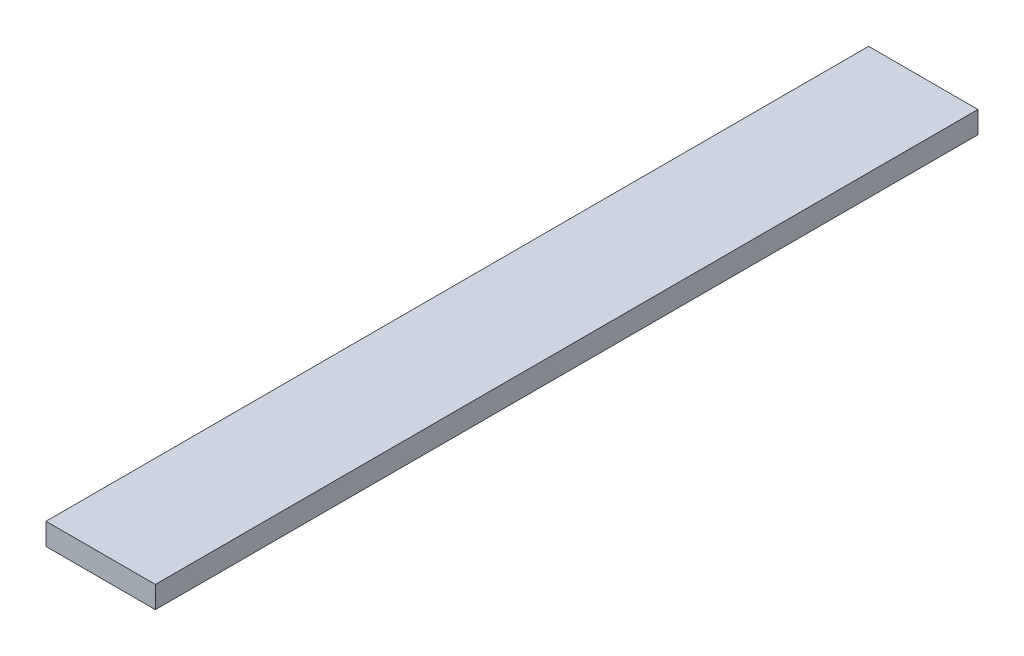
ISO-10303-21;
HEADER;
FILE_DESCRIPTION(('STEP AP214'),'2;1');
FILE_NAME('part.step','',(''),(''),'','','');
FILE_SCHEMA(('AUTOMOTIVE_DESIGN { 1 0 10303 214 1 1 1 1 }'));
ENDSEC;
DATA;
#1=APPLICATION_CONTEXT('core data for automotive mechanical design processes');
#2=APPLICATION_PROTOCOL_DEFINITION('international standard','automotive_design',2000,#1);
#3=PRODUCT_CONTEXT('',#1,'mechanical');
#4=PRODUCT('Part','Part','',(#3));
#5=PRODUCT_RELATED_PRODUCT_CATEGORY('part','',(#4));
#6=PRODUCT_DEFINITION_FORMATION('','',#4);
#7=PRODUCT_DEFINITION_CONTEXT('part definition',#1,'design');
#8=PRODUCT_DEFINITION('design','',#6,#7);
#9=PRODUCT_DEFINITION_SHAPE('','',#8);
#10=(LENGTH_UNIT() NAMED_UNIT(*) SI_UNIT(.MILLI.,.METRE.));
#11=(NAMED_UNIT(*) PLANE_ANGLE_UNIT() SI_UNIT($,.RADIAN.));
#12=(NAMED_UNIT(*) SI_UNIT($,.STERADIAN.) SOLID_ANGLE_UNIT());
#13=UNCERTAINTY_MEASURE_WITH_UNIT(LENGTH_MEASURE(1.E-05),#10,'distance_accuracy_value','');
#14=(GEOMETRIC_REPRESENTATION_CONTEXT(3) GLOBAL_UNCERTAINTY_ASSIGNED_CONTEXT((#13)) GLOBAL_UNIT_ASSIGNED_CONTEXT((#10,
#11,#12)) REPRESENTATION_CONTEXT('',''));
#15=CARTESIAN_POINT('',(0.,0.,0.));
#16=DIRECTION('',(0.,0.,1.));
#17=DIRECTION('',(1.,0.,0.));
#18=AXIS2_PLACEMENT_3D('',#15,#16,#17);
#19=CARTESIAN_POINT('',(0.,2.02999999999,0.));
#20=DIRECTION('',(0.,1.,0.));
#21=DIRECTION('',(0.,0.,1.));
#22=AXIS2_PLACEMENT_3D('',#19,#20,#21);
#23=PLANE('',#22);
#24=DIRECTION('',(0.,0.,1.));
#25=VECTOR('',#24,1.);
#26=CARTESIAN_POINT('',(2.375,2.02999999999,0.195));
#27=LINE('',#26,#25);
#28=CARTESIAN_POINT('',(2.375,2.02999999999,0.195));
#29=VERTEX_POINT('',#28);
#30=CARTESIAN_POINT('',(2.375,2.02999999999,2.075));
#31=VERTEX_POINT('',#30);
#32=EDGE_CURVE('E80',#29,#31,#27,.T.);
#33=ORIENTED_EDGE('',*,*,#32,.T.);
#34=DIRECTION('',(-1.,0.,0.));
#35=VECTOR('',#34,1.);
#36=CARTESIAN_POINT('',(2.375,2.02999999999,2.075));
#37=LINE('',#36,#35);
#38=CARTESIAN_POINT('',(2.125,2.02999999999,2.075));
#39=VERTEX_POINT('',#38);
#40=EDGE_CURVE('E67',#31,#39,#37,.T.);
#41=ORIENTED_EDGE('',*,*,#40,.T.);
#42=DIRECTION('',(0.,0.,1.));
#43=VECTOR('',#42,1.);
#44=CARTESIAN_POINT('',(2.125,2.02999999999,0.195));
#45=LINE('',#44,#43);
#46=CARTESIAN_POINT('',(2.125,2.02999999999,0.195));
#47=VERTEX_POINT('',#46);
#48=EDGE_CURVE('E54',#39,#47,#45,.F.);
#49=ORIENTED_EDGE('',*,*,#48,.T.);
#50=DIRECTION('',(1.,0.,0.));
#51=VECTOR('',#50,1.);
#52=CARTESIAN_POINT('',(2.375,2.02999999999,0.195));
#53=LINE('',#52,#51);
#54=EDGE_CURVE('E19',#47,#29,#53,.T.);
#55=ORIENTED_EDGE('',*,*,#54,.T.);
#56=EDGE_LOOP('',(#33,#41,#49,#55));
#57=FACE_BOUND('',#56,.T.);
#58=ADVANCED_FACE('F16',(#57),#23,.F.);
#59=CARTESIAN_POINT('',(2.375,2.07999999999,0.195));
#60=DIRECTION('',(0.,0.,1.));
#61=DIRECTION('',(1.,0.,0.));
#62=AXIS2_PLACEMENT_3D('',#59,#60,#61);
#63=PLANE('',#62);
#64=DIRECTION('',(0.,1.,0.));
#65=VECTOR('',#64,1.);
#66=CARTESIAN_POINT('',(2.125,2.07999999999,0.195));
#67=LINE('',#66,#65);
#68=CARTESIAN_POINT('',(2.125,2.07999999999,0.195));
#69=VERTEX_POINT('',#68);
#70=EDGE_CURVE('E60',#47,#69,#67,.T.);
#71=ORIENTED_EDGE('',*,*,#70,.T.);
#72=DIRECTION('',(1.,0.,0.));
#73=VECTOR('',#72,1.);
#74=CARTESIAN_POINT('',(0.,2.07999999999,0.195));
#75=LINE('',#74,#73);
#76=CARTESIAN_POINT('',(2.375,2.07999999999,0.195));
#77=VERTEX_POINT('',#76);
#78=EDGE_CURVE('E82',#77,#69,#75,.F.);
#79=ORIENTED_EDGE('',*,*,#78,.F.);
#80=DIRECTION('',(0.,-1.,0.));
#81=VECTOR('',#80,1.);
#82=CARTESIAN_POINT('',(2.375,2.07999999999,0.195));
#83=LINE('',#82,#81);
#84=EDGE_CURVE('E63',#77,#29,#83,.T.);
#85=ORIENTED_EDGE('',*,*,#84,.T.);
#86=ORIENTED_EDGE('',*,*,#54,.F.);
#87=EDGE_LOOP('',(#71,#79,#85,#86));
#88=FACE_BOUND('',#87,.T.);
#89=ADVANCED_FACE('F59',(#88),#63,.F.);
#90=CARTESIAN_POINT('',(2.125,2.07999999999,0.195));
#91=DIRECTION('',(1.,0.,0.));
#92=DIRECTION('',(0.,1.,0.));
#93=AXIS2_PLACEMENT_3D('',#90,#91,#92);
#94=PLANE('',#93);
#95=DIRECTION('',(0.,1.,0.));
#96=VECTOR('',#95,1.);
#97=CARTESIAN_POINT('',(2.125,2.07999999999,2.075));
#98=LINE('',#97,#96);
#99=CARTESIAN_POINT('',(2.125,2.07999999999,2.075));
#100=VERTEX_POINT('',#99);
#101=EDGE_CURVE('E69',#39,#100,#98,.T.);
#102=ORIENTED_EDGE('',*,*,#101,.T.);
#103=DIRECTION('',(0.,0.,1.));
#104=VECTOR('',#103,1.);
#105=CARTESIAN_POINT('',(2.125,2.07999999999,0.));
#106=LINE('',#105,#104);
#107=EDGE_CURVE('E73',#69,#100,#106,.T.);
#108=ORIENTED_EDGE('',*,*,#107,.F.);
#109=ORIENTED_EDGE('',*,*,#70,.F.);
#110=ORIENTED_EDGE('',*,*,#48,.F.);
#111=EDGE_LOOP('',(#102,#108,#109,#110));
#112=FACE_BOUND('',#111,.T.);
#113=ADVANCED_FACE('F71',(#112),#94,.F.);
#114=CARTESIAN_POINT('',(2.375,2.07999999999,2.075));
#115=DIRECTION('',(0.,0.,-1.));
#116=DIRECTION('',(-1.,0.,0.));
#117=AXIS2_PLACEMENT_3D('',#114,#115,#116);
#118=PLANE('',#117);
#119=DIRECTION('',(0.,-1.,0.));
#120=VECTOR('',#119,1.);
#121=CARTESIAN_POINT('',(2.375,2.07999999999,2.075));
#122=LINE('',#121,#120);
#123=CARTESIAN_POINT('',(2.375,2.07999999999,2.075));
#124=VERTEX_POINT('',#123);
#125=EDGE_CURVE('E34',#31,#124,#122,.F.);
#126=ORIENTED_EDGE('',*,*,#125,.T.);
#127=DIRECTION('',(1.,0.,0.));
#128=VECTOR('',#127,1.);
#129=CARTESIAN_POINT('',(0.,2.07999999999,2.075));
#130=LINE('',#129,#128);
#131=EDGE_CURVE('E25',#100,#124,#130,.T.);
#132=ORIENTED_EDGE('',*,*,#131,.F.);
#133=ORIENTED_EDGE('',*,*,#101,.F.);
#134=ORIENTED_EDGE('',*,*,#40,.F.);
#135=EDGE_LOOP('',(#126,#132,#133,#134));
#136=FACE_BOUND('',#135,.T.);
#137=ADVANCED_FACE('F88',(#136),#118,.F.);
#138=CARTESIAN_POINT('',(2.375,2.07999999999,0.195));
#139=DIRECTION('',(-1.,0.,0.));
#140=DIRECTION('',(0.,-1.,0.));
#141=AXIS2_PLACEMENT_3D('',#138,#139,#140);
#142=PLANE('',#141);
#143=ORIENTED_EDGE('',*,*,#84,.F.);
#144=DIRECTION('',(0.,0.,1.));
#145=VECTOR('',#144,1.);
#146=CARTESIAN_POINT('',(2.375,2.07999999999,0.));
#147=LINE('',#146,#145);
#148=EDGE_CURVE('E11',#124,#77,#147,.F.);
#149=ORIENTED_EDGE('',*,*,#148,.F.);
#150=ORIENTED_EDGE('',*,*,#125,.F.);
#151=ORIENTED_EDGE('',*,*,#32,.F.);
#152=EDGE_LOOP('',(#143,#149,#150,#151));
#153=FACE_BOUND('',#152,.T.);
#154=ADVANCED_FACE('F90',(#153),#142,.F.);
#155=CARTESIAN_POINT('',(0.,2.07999999999,0.));
#156=DIRECTION('',(0.,1.,0.));
#157=DIRECTION('',(0.,0.,1.));
#158=AXIS2_PLACEMENT_3D('',#155,#156,#157);
#159=PLANE('',#158);
#160=ORIENTED_EDGE('',*,*,#131,.T.);
#161=ORIENTED_EDGE('',*,*,#148,.T.);
#162=ORIENTED_EDGE('',*,*,#78,.T.);
#163=ORIENTED_EDGE('',*,*,#107,.T.);
#164=EDGE_LOOP('',(#160,#161,#162,#163));
#165=FACE_BOUND('',#164,.T.);
#166=ADVANCED_FACE('F87',(#165),#159,.T.);
#167=CLOSED_SHELL('',(#58,#89,#113,#137,#154,#166));
#168=MANIFOLD_SOLID_BREP('B1',#167);
#169=ADVANCED_BREP_SHAPE_REPRESENTATION('',(#18,#168),#14);
#170=SHAPE_DEFINITION_REPRESENTATION(#9,#169);
ENDSEC;
END-ISO-10303-21;
